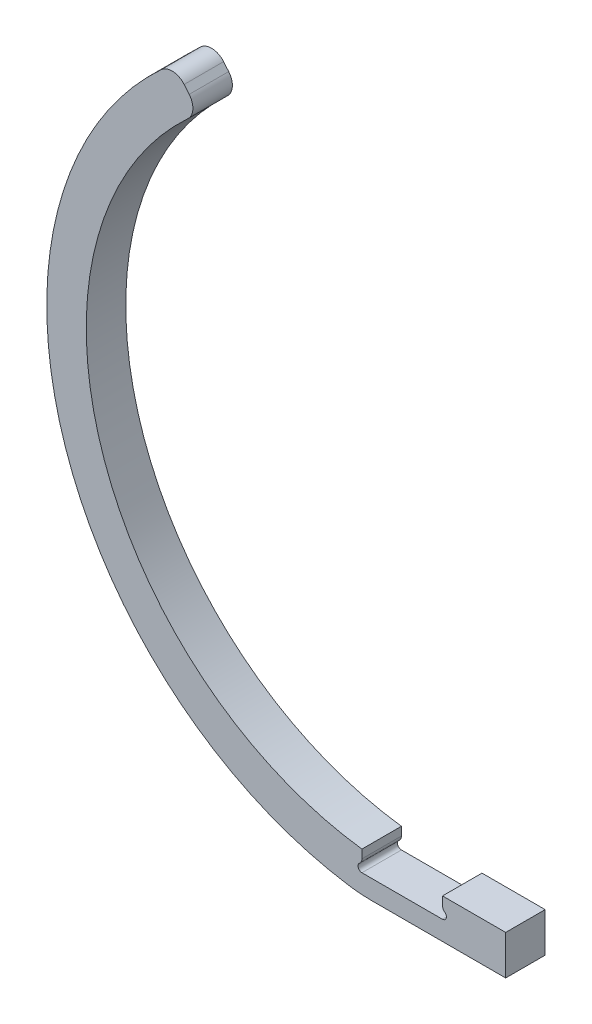
ISO-10303-21;
HEADER;
FILE_DESCRIPTION(('STEP AP214'),'2;1');
FILE_NAME('part.step','',(''),(''),'','','');
FILE_SCHEMA(('AUTOMOTIVE_DESIGN { 1 0 10303 214 1 1 1 1 }'));
ENDSEC;
DATA;
#1=APPLICATION_CONTEXT('core data for automotive mechanical design processes');
#2=APPLICATION_PROTOCOL_DEFINITION('international standard','automotive_design',2000,#1);
#3=PRODUCT_CONTEXT('',#1,'mechanical');
#4=PRODUCT('Part','Part','',(#3));
#5=PRODUCT_RELATED_PRODUCT_CATEGORY('part','',(#4));
#6=PRODUCT_DEFINITION_FORMATION('','',#4);
#7=PRODUCT_DEFINITION_CONTEXT('part definition',#1,'design');
#8=PRODUCT_DEFINITION('design','',#6,#7);
#9=PRODUCT_DEFINITION_SHAPE('','',#8);
#10=(LENGTH_UNIT() NAMED_UNIT(*) SI_UNIT(.MILLI.,.METRE.));
#11=(NAMED_UNIT(*) PLANE_ANGLE_UNIT() SI_UNIT($,.RADIAN.));
#12=(NAMED_UNIT(*) SI_UNIT($,.STERADIAN.) SOLID_ANGLE_UNIT());
#13=UNCERTAINTY_MEASURE_WITH_UNIT(LENGTH_MEASURE(1.E-05),#10,'distance_accuracy_value','');
#14=(GEOMETRIC_REPRESENTATION_CONTEXT(3) GLOBAL_UNCERTAINTY_ASSIGNED_CONTEXT((#13)) GLOBAL_UNIT_ASSIGNED_CONTEXT((#10,
#11,#12)) REPRESENTATION_CONTEXT('',''));
#15=CARTESIAN_POINT('',(0.,0.,0.));
#16=DIRECTION('',(0.,0.,1.));
#17=DIRECTION('',(1.,0.,0.));
#18=AXIS2_PLACEMENT_3D('',#15,#16,#17);
#19=CARTESIAN_POINT('',(0.,0.,6.35));
#20=DIRECTION('',(0.766044443118976,0.642787609686541,0.));
#21=DIRECTION('',(-0.642787609686541,0.766044443118977,0.));
#22=AXIS2_PLACEMENT_3D('',#19,#20,#21);
#23=PLANE('',#22);
#24=DIRECTION('',(0.642787609686541,-0.766044443118977,0.));
#25=VECTOR('',#24,1.);
#26=CARTESIAN_POINT('',(0.,0.,0.));
#27=LINE('',#26,#25);
#28=CARTESIAN_POINT('',(-35.0646414930673,41.7884124723908,0.));
#29=VERTEX_POINT('',#28);
#30=CARTESIAN_POINT('',(-34.247395692696,40.8144568537658,0.));
#31=VERTEX_POINT('',#30);
#32=EDGE_CURVE('E283',#29,#31,#27,.T.);
#33=ORIENTED_EDGE('',*,*,#32,.F.);
#34=DIRECTION('',(0.,0.,-1.));
#35=VECTOR('',#34,1.);
#36=CARTESIAN_POINT('',(-35.0646414930673,41.7884124723908,6.35));
#37=LINE('',#36,#35);
#38=CARTESIAN_POINT('',(-35.0646414930673,41.7884124723908,6.35));
#39=VERTEX_POINT('',#38);
#40=EDGE_CURVE('E165',#39,#29,#37,.T.);
#41=ORIENTED_EDGE('',*,*,#40,.F.);
#42=DIRECTION('',(0.642787609686541,-0.766044443118977,0.));
#43=VECTOR('',#42,1.);
#44=CARTESIAN_POINT('',(0.,0.,6.35));
#45=LINE('',#44,#43);
#46=CARTESIAN_POINT('',(-34.247395692696,40.8144568537658,6.35));
#47=VERTEX_POINT('',#46);
#48=EDGE_CURVE('E196',#39,#47,#45,.T.);
#49=ORIENTED_EDGE('',*,*,#48,.T.);
#50=DIRECTION('',(0.,0.,-1.));
#51=VECTOR('',#50,1.);
#52=CARTESIAN_POINT('',(-34.247395692696,40.8144568537658,6.35));
#53=LINE('',#52,#51);
#54=EDGE_CURVE('E197',#47,#31,#53,.T.);
#55=ORIENTED_EDGE('',*,*,#54,.T.);
#56=EDGE_LOOP('',(#33,#41,#49,#55));
#57=FACE_BOUND('',#56,.T.);
#58=ADVANCED_FACE('F42',(#57),#23,.T.);
#59=CARTESIAN_POINT('',(-37.0103943785895,40.155731943787,6.35));
#60=DIRECTION('',(0.,0.,-1.));
#61=DIRECTION('',(-1.,0.,0.));
#62=AXIS2_PLACEMENT_3D('',#59,#60,#61);
#63=CYLINDRICAL_SURFACE('',#62,2.54);
#64=CARTESIAN_POINT('',(-37.0103943785895,40.155731943787,0.));
#65=DIRECTION('',(0.,0.,1.));
#66=DIRECTION('',(1.,0.,0.));
#67=AXIS2_PLACEMENT_3D('',#64,#65,#66);
#68=CIRCLE('',#67,2.54);
#69=CARTESIAN_POINT('',(-38.7318080706169,42.0234404062887,0.));
#70=VERTEX_POINT('',#69);
#71=EDGE_CURVE('E251',#29,#70,#68,.T.);
#72=ORIENTED_EDGE('',*,*,#71,.T.);
#73=DIRECTION('',(0.,0.,-1.));
#74=VECTOR('',#73,1.);
#75=CARTESIAN_POINT('',(-38.7318080706169,42.0234404062887,6.35));
#76=LINE('',#75,#74);
#77=CARTESIAN_POINT('',(-38.7318080706169,42.0234404062887,6.35));
#78=VERTEX_POINT('',#77);
#79=EDGE_CURVE('E213',#78,#70,#76,.T.);
#80=ORIENTED_EDGE('',*,*,#79,.F.);
#81=CARTESIAN_POINT('',(-37.0103943785895,40.155731943787,6.35));
#82=DIRECTION('',(0.,0.,1.));
#83=DIRECTION('',(1.,0.,0.));
#84=AXIS2_PLACEMENT_3D('',#81,#82,#83);
#85=CIRCLE('',#84,2.54);
#86=EDGE_CURVE('E292',#39,#78,#85,.T.);
#87=ORIENTED_EDGE('',*,*,#86,.F.);
#88=ORIENTED_EDGE('',*,*,#40,.T.);
#89=EDGE_LOOP('',(#72,#80,#87,#88));
#90=FACE_BOUND('',#89,.T.);
#91=ADVANCED_FACE('F288',(#90),#63,.T.);
#92=CARTESIAN_POINT('',(0.,0.,6.35));
#93=DIRECTION('',(0.,0.,-1.));
#94=DIRECTION('',(-1.,0.,0.));
#95=AXIS2_PLACEMENT_3D('',#92,#93,#94);
#96=CYLINDRICAL_SURFACE('',#95,57.15);
#97=CARTESIAN_POINT('',(0.,0.,0.));
#98=DIRECTION('',(0.,0.,1.));
#99=DIRECTION('',(1.,0.,0.));
#100=AXIS2_PLACEMENT_3D('',#97,#98,#99);
#101=CIRCLE('',#100,57.15);
#102=CARTESIAN_POINT('',(-8.67856626583688,-56.4872108319173,0.));
#103=VERTEX_POINT('',#102);
#104=EDGE_CURVE('E248',#70,#103,#101,.T.);
#105=ORIENTED_EDGE('',*,*,#104,.T.);
#106=DIRECTION('',(0.,0.,-1.));
#107=VECTOR('',#106,1.);
#108=CARTESIAN_POINT('',(-8.67856626583688,-56.4872108319173,6.35));
#109=LINE('',#108,#107);
#110=CARTESIAN_POINT('',(-8.67856626583688,-56.4872108319173,6.35));
#111=VERTEX_POINT('',#110);
#112=EDGE_CURVE('E50',#103,#111,#109,.F.);
#113=ORIENTED_EDGE('',*,*,#112,.T.);
#114=CARTESIAN_POINT('',(0.,0.,6.35));
#115=DIRECTION('',(0.,0.,1.));
#116=DIRECTION('',(1.,0.,0.));
#117=AXIS2_PLACEMENT_3D('',#114,#115,#116);
#118=CIRCLE('',#117,57.15);
#119=EDGE_CURVE('E271',#78,#111,#118,.T.);
#120=ORIENTED_EDGE('',*,*,#119,.F.);
#121=ORIENTED_EDGE('',*,*,#79,.T.);
#122=EDGE_LOOP('',(#105,#113,#120,#121));
#123=FACE_BOUND('',#122,.T.);
#124=ADVANCED_FACE('F291',(#123),#96,.T.);
#125=CARTESIAN_POINT('',(0.,-56.7817837955096,6.35));
#126=DIRECTION('',(0.,1.,0.));
#127=DIRECTION('',(0.,0.,1.));
#128=AXIS2_PLACEMENT_3D('',#125,#126,#127);
#129=PLANE('',#128);
#130=DIRECTION('',(1.,0.,0.));
#131=VECTOR('',#130,1.);
#132=CARTESIAN_POINT('',(0.,-56.7817837955096,6.35));
#133=LINE('',#132,#131);
#134=CARTESIAN_POINT('',(-4.82142570324271,-56.7817837955096,6.35));
#135=VERTEX_POINT('',#134);
#136=CARTESIAN_POINT('',(16.637,-56.7817837955096,6.35));
#137=VERTEX_POINT('',#136);
#138=EDGE_CURVE('E241',#135,#137,#133,.T.);
#139=ORIENTED_EDGE('',*,*,#138,.F.);
#140=DIRECTION('',(0.,0.,-1.));
#141=VECTOR('',#140,1.);
#142=CARTESIAN_POINT('',(-4.82142570324271,-56.7817837955096,6.35));
#143=LINE('',#142,#141);
#144=CARTESIAN_POINT('',(-4.82142570324271,-56.7817837955096,0.));
#145=VERTEX_POINT('',#144);
#146=EDGE_CURVE('E232',#135,#145,#143,.T.);
#147=ORIENTED_EDGE('',*,*,#146,.T.);
#148=DIRECTION('',(1.,0.,0.));
#149=VECTOR('',#148,1.);
#150=CARTESIAN_POINT('',(0.,-56.7817837955096,0.));
#151=LINE('',#150,#149);
#152=CARTESIAN_POINT('',(16.637,-56.7817837955096,0.));
#153=VERTEX_POINT('',#152);
#154=EDGE_CURVE('E240',#145,#153,#151,.T.);
#155=ORIENTED_EDGE('',*,*,#154,.T.);
#156=DIRECTION('',(0.,0.,-1.));
#157=VECTOR('',#156,1.);
#158=CARTESIAN_POINT('',(16.637,-56.7817837955096,6.35));
#159=LINE('',#158,#157);
#160=EDGE_CURVE('E210',#137,#153,#159,.T.);
#161=ORIENTED_EDGE('',*,*,#160,.F.);
#162=EDGE_LOOP('',(#139,#147,#155,#161));
#163=FACE_BOUND('',#162,.T.);
#164=ADVANCED_FACE('F238',(#163),#129,.F.);
#165=CARTESIAN_POINT('',(16.637,0.,6.35));
#166=DIRECTION('',(1.,0.,0.));
#167=DIRECTION('',(0.,0.,-1.));
#168=AXIS2_PLACEMENT_3D('',#165,#166,#167);
#169=PLANE('',#168);
#170=DIRECTION('',(0.,-1.,0.));
#171=VECTOR('',#170,1.);
#172=CARTESIAN_POINT('',(16.637,0.,0.));
#173=LINE('',#172,#171);
#174=CARTESIAN_POINT('',(16.637,-50.4317837955096,0.));
#175=VERTEX_POINT('',#174);
#176=EDGE_CURVE('E247',#175,#153,#173,.T.);
#177=ORIENTED_EDGE('',*,*,#176,.F.);
#178=DIRECTION('',(0.,0.,-1.));
#179=VECTOR('',#178,1.);
#180=CARTESIAN_POINT('',(16.637,-50.4317837955096,6.35));
#181=LINE('',#180,#179);
#182=CARTESIAN_POINT('',(16.637,-50.4317837955096,6.35));
#183=VERTEX_POINT('',#182);
#184=EDGE_CURVE('E208',#183,#175,#181,.T.);
#185=ORIENTED_EDGE('',*,*,#184,.F.);
#186=DIRECTION('',(0.,-1.,0.));
#187=VECTOR('',#186,1.);
#188=CARTESIAN_POINT('',(16.637,0.,6.35));
#189=LINE('',#188,#187);
#190=EDGE_CURVE('E266',#183,#137,#189,.T.);
#191=ORIENTED_EDGE('',*,*,#190,.T.);
#192=ORIENTED_EDGE('',*,*,#160,.T.);
#193=EDGE_LOOP('',(#177,#185,#191,#192));
#194=FACE_BOUND('',#193,.T.);
#195=ADVANCED_FACE('F265',(#194),#169,.T.);
#196=CARTESIAN_POINT('',(0.,-50.4317837955096,6.35));
#197=DIRECTION('',(0.,1.,0.));
#198=DIRECTION('',(0.,0.,1.));
#199=AXIS2_PLACEMENT_3D('',#196,#197,#198);
#200=PLANE('',#199);
#201=DIRECTION('',(1.,0.,0.));
#202=VECTOR('',#201,1.);
#203=CARTESIAN_POINT('',(0.,-50.4317837955096,0.));
#204=LINE('',#203,#202);
#205=CARTESIAN_POINT('',(6.477,-50.4317837955096,0.));
#206=VERTEX_POINT('',#205);
#207=EDGE_CURVE('E187',#206,#175,#204,.T.);
#208=ORIENTED_EDGE('',*,*,#207,.F.);
#209=DIRECTION('',(0.,0.,-1.));
#210=VECTOR('',#209,1.);
#211=CARTESIAN_POINT('',(6.477,-50.4317837955096,6.35));
#212=LINE('',#211,#210);
#213=CARTESIAN_POINT('',(6.477,-50.4317837955096,6.35));
#214=VERTEX_POINT('',#213);
#215=EDGE_CURVE('E175',#214,#206,#212,.T.);
#216=ORIENTED_EDGE('',*,*,#215,.F.);
#217=DIRECTION('',(1.,0.,0.));
#218=VECTOR('',#217,1.);
#219=CARTESIAN_POINT('',(0.,-50.4317837955096,6.35));
#220=LINE('',#219,#218);
#221=EDGE_CURVE('E261',#214,#183,#220,.T.);
#222=ORIENTED_EDGE('',*,*,#221,.T.);
#223=ORIENTED_EDGE('',*,*,#184,.T.);
#224=EDGE_LOOP('',(#208,#216,#222,#223));
#225=FACE_BOUND('',#224,.T.);
#226=ADVANCED_FACE('F258',(#225),#200,.T.);
#227=CARTESIAN_POINT('',(6.477,0.,6.35));
#228=DIRECTION('',(-1.,0.,0.));
#229=DIRECTION('',(0.,0.,1.));
#230=AXIS2_PLACEMENT_3D('',#227,#228,#229);
#231=PLANE('',#230);
#232=DIRECTION('',(0.,1.,0.));
#233=VECTOR('',#232,1.);
#234=CARTESIAN_POINT('',(6.477,0.,0.));
#235=LINE('',#234,#233);
#236=CARTESIAN_POINT('',(6.477,-51.7466210482328,0.));
#237=VERTEX_POINT('',#236);
#238=EDGE_CURVE('E183',#237,#206,#235,.T.);
#239=ORIENTED_EDGE('',*,*,#238,.F.);
#240=DIRECTION('',(0.,0.,-1.));
#241=VECTOR('',#240,1.);
#242=CARTESIAN_POINT('',(6.477,-51.7466210482328,6.35));
#243=LINE('',#242,#241);
#244=CARTESIAN_POINT('',(6.477,-51.7466210482328,6.35));
#245=VERTEX_POINT('',#244);
#246=EDGE_CURVE('E230',#237,#245,#243,.F.);
#247=ORIENTED_EDGE('',*,*,#246,.T.);
#248=DIRECTION('',(0.,1.,0.));
#249=VECTOR('',#248,1.);
#250=CARTESIAN_POINT('',(6.477,0.,6.35));
#251=LINE('',#250,#249);
#252=EDGE_CURVE('E269',#245,#214,#251,.T.);
#253=ORIENTED_EDGE('',*,*,#252,.T.);
#254=ORIENTED_EDGE('',*,*,#215,.T.);
#255=EDGE_LOOP('',(#239,#247,#253,#254));
#256=FACE_BOUND('',#255,.T.);
#257=ADVANCED_FACE('F313',(#256),#231,.T.);
#258=CARTESIAN_POINT('',(0.,-53.6829837955096,6.35));
#259=DIRECTION('',(0.,1.,0.));
#260=DIRECTION('',(0.,0.,1.));
#261=AXIS2_PLACEMENT_3D('',#258,#259,#260);
#262=PLANE('',#261);
#263=DIRECTION('',(1.,0.,0.));
#264=VECTOR('',#263,1.);
#265=CARTESIAN_POINT('',(0.,-53.6829837955096,0.));
#266=LINE('',#265,#264);
#267=CARTESIAN_POINT('',(-6.477,-53.6829837955096,0.));
#268=VERTEX_POINT('',#267);
#269=CARTESIAN_POINT('',(6.477,-53.6829837955096,0.));
#270=VERTEX_POINT('',#269);
#271=EDGE_CURVE('E172',#268,#270,#266,.T.);
#272=ORIENTED_EDGE('',*,*,#271,.F.);
#273=DIRECTION('',(0.,0.,-1.));
#274=VECTOR('',#273,1.);
#275=CARTESIAN_POINT('',(-6.477,-53.6829837955096,6.35));
#276=LINE('',#275,#274);
#277=CARTESIAN_POINT('',(-6.477,-53.6829837955096,6.35));
#278=VERTEX_POINT('',#277);
#279=EDGE_CURVE('E176',#278,#268,#276,.T.);
#280=ORIENTED_EDGE('',*,*,#279,.F.);
#281=DIRECTION('',(1.,0.,0.));
#282=VECTOR('',#281,1.);
#283=CARTESIAN_POINT('',(0.,-53.6829837955096,6.35));
#284=LINE('',#283,#282);
#285=CARTESIAN_POINT('',(6.477,-53.6829837955096,6.35));
#286=VERTEX_POINT('',#285);
#287=EDGE_CURVE('E174',#278,#286,#284,.T.);
#288=ORIENTED_EDGE('',*,*,#287,.T.);
#289=DIRECTION('',(0.,0.,-1.));
#290=VECTOR('',#289,1.);
#291=CARTESIAN_POINT('',(6.477,-53.6829837955096,6.35));
#292=LINE('',#291,#290);
#293=EDGE_CURVE('E159',#286,#270,#292,.T.);
#294=ORIENTED_EDGE('',*,*,#293,.T.);
#295=EDGE_LOOP('',(#272,#280,#288,#294));
#296=FACE_BOUND('',#295,.T.);
#297=ADVANCED_FACE('F170',(#296),#262,.T.);
#298=CARTESIAN_POINT('',(-6.47700000000001,0.,6.35));
#299=DIRECTION('',(-1.,0.,0.));
#300=DIRECTION('',(0.,-1.,0.));
#301=AXIS2_PLACEMENT_3D('',#298,#299,#300);
#302=PLANE('',#301);
#303=DIRECTION('',(0.,1.,0.));
#304=VECTOR('',#303,1.);
#305=CARTESIAN_POINT('',(-6.47700000000001,0.,6.35));
#306=LINE('',#305,#304);
#307=CARTESIAN_POINT('',(-6.477,-51.7466210482328,6.35));
#308=VERTEX_POINT('',#307);
#309=CARTESIAN_POINT('',(-6.477,-50.3853993831546,6.35));
#310=VERTEX_POINT('',#309);
#311=EDGE_CURVE('E277',#308,#310,#306,.T.);
#312=ORIENTED_EDGE('',*,*,#311,.F.);
#313=DIRECTION('',(0.,0.,1.));
#314=VECTOR('',#313,1.);
#315=CARTESIAN_POINT('',(-6.477,-51.7466210482328,6.35));
#316=LINE('',#315,#314);
#317=CARTESIAN_POINT('',(-6.477,-51.7466210482328,0.));
#318=VERTEX_POINT('',#317);
#319=EDGE_CURVE('E164',#308,#318,#316,.F.);
#320=ORIENTED_EDGE('',*,*,#319,.T.);
#321=DIRECTION('',(0.,1.,0.));
#322=VECTOR('',#321,1.);
#323=CARTESIAN_POINT('',(-6.47700000000001,0.,0.));
#324=LINE('',#323,#322);
#325=CARTESIAN_POINT('',(-6.477,-50.3853993831546,0.));
#326=VERTEX_POINT('',#325);
#327=EDGE_CURVE('E182',#318,#326,#324,.T.);
#328=ORIENTED_EDGE('',*,*,#327,.T.);
#329=DIRECTION('',(0.,0.,-1.));
#330=VECTOR('',#329,1.);
#331=CARTESIAN_POINT('',(-6.477,-50.3853993831546,6.35));
#332=LINE('',#331,#330);
#333=EDGE_CURVE('E202',#310,#326,#332,.T.);
#334=ORIENTED_EDGE('',*,*,#333,.F.);
#335=EDGE_LOOP('',(#312,#320,#328,#334));
#336=FACE_BOUND('',#335,.T.);
#337=ADVANCED_FACE('F320',(#336),#302,.F.);
#338=CARTESIAN_POINT('',(0.,0.,6.35));
#339=DIRECTION('',(0.,0.,-1.));
#340=DIRECTION('',(-1.,0.,0.));
#341=AXIS2_PLACEMENT_3D('',#338,#339,#340);
#342=CYLINDRICAL_SURFACE('',#341,50.8);
#343=CARTESIAN_POINT('',(0.,0.,0.));
#344=DIRECTION('',(0.,0.,1.));
#345=DIRECTION('',(1.,0.,0.));
#346=AXIS2_PLACEMENT_3D('',#343,#344,#345);
#347=CIRCLE('',#346,50.8);
#348=CARTESIAN_POINT('',(-34.4696653125887,37.3159774525352,0.));
#349=VERTEX_POINT('',#348);
#350=EDGE_CURVE('E185',#349,#326,#347,.T.);
#351=ORIENTED_EDGE('',*,*,#350,.F.);
#352=DIRECTION('',(0.,0.,-1.));
#353=VECTOR('',#352,1.);
#354=CARTESIAN_POINT('',(-34.4696653125887,37.3159774525352,6.35));
#355=LINE('',#354,#353);
#356=CARTESIAN_POINT('',(-34.4696653125887,37.3159774525352,6.35));
#357=VERTEX_POINT('',#356);
#358=EDGE_CURVE('E199',#357,#349,#355,.T.);
#359=ORIENTED_EDGE('',*,*,#358,.F.);
#360=CARTESIAN_POINT('',(0.,0.,6.35));
#361=DIRECTION('',(0.,0.,1.));
#362=DIRECTION('',(1.,0.,0.));
#363=AXIS2_PLACEMENT_3D('',#360,#361,#362);
#364=CIRCLE('',#363,50.8);
#365=EDGE_CURVE('E279',#357,#310,#364,.T.);
#366=ORIENTED_EDGE('',*,*,#365,.T.);
#367=ORIENTED_EDGE('',*,*,#333,.T.);
#368=EDGE_LOOP('',(#351,#359,#366,#367));
#369=FACE_BOUND('',#368,.T.);
#370=ADVANCED_FACE('F413',(#369),#342,.F.);
#371=CARTESIAN_POINT('',(-36.1931485782182,39.181776325162,6.35));
#372=DIRECTION('',(0.,0.,-1.));
#373=DIRECTION('',(-1.,0.,0.));
#374=AXIS2_PLACEMENT_3D('',#371,#372,#373);
#375=CYLINDRICAL_SURFACE('',#374,2.54);
#376=CARTESIAN_POINT('',(-36.1931485782182,39.181776325162,0.));
#377=DIRECTION('',(0.,0.,1.));
#378=DIRECTION('',(1.,0.,0.));
#379=AXIS2_PLACEMENT_3D('',#376,#377,#378);
#380=CIRCLE('',#379,2.54);
#381=EDGE_CURVE('E193',#349,#31,#380,.T.);
#382=ORIENTED_EDGE('',*,*,#381,.T.);
#383=ORIENTED_EDGE('',*,*,#54,.F.);
#384=CARTESIAN_POINT('',(-36.1931485782182,39.181776325162,6.35));
#385=DIRECTION('',(0.,0.,1.));
#386=DIRECTION('',(1.,0.,0.));
#387=AXIS2_PLACEMENT_3D('',#384,#385,#386);
#388=CIRCLE('',#387,2.54);
#389=EDGE_CURVE('E200',#357,#47,#388,.T.);
#390=ORIENTED_EDGE('',*,*,#389,.F.);
#391=ORIENTED_EDGE('',*,*,#358,.T.);
#392=EDGE_LOOP('',(#382,#383,#390,#391));
#393=FACE_BOUND('',#392,.T.);
#394=ADVANCED_FACE('F361',(#393),#375,.T.);
#395=CARTESIAN_POINT('',(0.,0.,6.35));
#396=DIRECTION('',(0.,0.,1.));
#397=DIRECTION('',(1.,0.,0.));
#398=AXIS2_PLACEMENT_3D('',#395,#396,#397);
#399=PLANE('',#398);
#400=ORIENTED_EDGE('',*,*,#119,.T.);
#401=CARTESIAN_POINT('',(-4.82142570324271,-31.3817837955096,6.35));
#402=DIRECTION('',(0.,0.,1.));
#403=DIRECTION('',(1.,0.,0.));
#404=AXIS2_PLACEMENT_3D('',#401,#402,#403);
#405=CIRCLE('',#404,25.4);
#406=EDGE_CURVE('E11',#111,#135,#405,.T.);
#407=ORIENTED_EDGE('',*,*,#406,.T.);
#408=ORIENTED_EDGE('',*,*,#138,.T.);
#409=ORIENTED_EDGE('',*,*,#190,.F.);
#410=ORIENTED_EDGE('',*,*,#221,.F.);
#411=ORIENTED_EDGE('',*,*,#252,.F.);
#412=CARTESIAN_POINT('',(7.493,-51.7466210482328,6.35));
#413=DIRECTION('',(0.,0.,1.));
#414=DIRECTION('',(1.,0.,0.));
#415=AXIS2_PLACEMENT_3D('',#412,#413,#414);
#416=CIRCLE('',#415,1.016);
#417=CARTESIAN_POINT('',(6.86776923076923,-52.5474596619416,6.35));
#418=VERTEX_POINT('',#417);
#419=EDGE_CURVE('E225',#245,#418,#416,.T.);
#420=ORIENTED_EDGE('',*,*,#419,.T.);
#421=CARTESIAN_POINT('',(6.477,-53.0479837955096,6.35));
#422=DIRECTION('',(0.,0.,1.));
#423=DIRECTION('',(1.,0.,0.));
#424=AXIS2_PLACEMENT_3D('',#421,#422,#423);
#425=CIRCLE('',#424,0.635000000000001);
#426=EDGE_CURVE('E297',#286,#418,#425,.T.);
#427=ORIENTED_EDGE('',*,*,#426,.F.);
#428=ORIENTED_EDGE('',*,*,#287,.F.);
#429=CARTESIAN_POINT('',(-6.477,-53.0479837955096,6.35));
#430=DIRECTION('',(0.,0.,1.));
#431=DIRECTION('',(1.,0.,0.));
#432=AXIS2_PLACEMENT_3D('',#429,#430,#431);
#433=CIRCLE('',#432,0.635000000000001);
#434=CARTESIAN_POINT('',(-6.86776923076923,-52.5474596619416,6.35));
#435=VERTEX_POINT('',#434);
#436=EDGE_CURVE('E299',#435,#278,#433,.T.);
#437=ORIENTED_EDGE('',*,*,#436,.F.);
#438=CARTESIAN_POINT('',(-7.493,-51.7466210482328,6.35));
#439=DIRECTION('',(0.,0.,1.));
#440=DIRECTION('',(1.,0.,0.));
#441=AXIS2_PLACEMENT_3D('',#438,#439,#440);
#442=CIRCLE('',#441,1.016);
#443=EDGE_CURVE('E227',#435,#308,#442,.T.);
#444=ORIENTED_EDGE('',*,*,#443,.T.);
#445=ORIENTED_EDGE('',*,*,#311,.T.);
#446=ORIENTED_EDGE('',*,*,#365,.F.);
#447=ORIENTED_EDGE('',*,*,#389,.T.);
#448=ORIENTED_EDGE('',*,*,#48,.F.);
#449=ORIENTED_EDGE('',*,*,#86,.T.);
#450=EDGE_LOOP('',(#400,#407,#408,#409,#410,#411,#420,#427,#428,#437,#444,#445,#446,#447,#448,#449));
#451=FACE_BOUND('',#450,.T.);
#452=ADVANCED_FACE('F306',(#451),#399,.T.);
#453=CARTESIAN_POINT('',(0.,0.,0.));
#454=DIRECTION('',(0.,0.,1.));
#455=DIRECTION('',(1.,0.,0.));
#456=AXIS2_PLACEMENT_3D('',#453,#454,#455);
#457=PLANE('',#456);
#458=ORIENTED_EDGE('',*,*,#154,.F.);
#459=CARTESIAN_POINT('',(-4.82142570324271,-31.3817837955096,0.));
#460=DIRECTION('',(0.,0.,1.));
#461=DIRECTION('',(1.,0.,0.));
#462=AXIS2_PLACEMENT_3D('',#459,#460,#461);
#463=CIRCLE('',#462,25.4);
#464=EDGE_CURVE('E64',#145,#103,#463,.F.);
#465=ORIENTED_EDGE('',*,*,#464,.T.);
#466=ORIENTED_EDGE('',*,*,#104,.F.);
#467=ORIENTED_EDGE('',*,*,#71,.F.);
#468=ORIENTED_EDGE('',*,*,#32,.T.);
#469=ORIENTED_EDGE('',*,*,#381,.F.);
#470=ORIENTED_EDGE('',*,*,#350,.T.);
#471=ORIENTED_EDGE('',*,*,#327,.F.);
#472=CARTESIAN_POINT('',(-7.493,-51.7466210482328,0.));
#473=DIRECTION('',(0.,0.,1.));
#474=DIRECTION('',(1.,0.,0.));
#475=AXIS2_PLACEMENT_3D('',#472,#473,#474);
#476=CIRCLE('',#475,1.016);
#477=CARTESIAN_POINT('',(-6.86776923076923,-52.5474596619416,0.));
#478=VERTEX_POINT('',#477);
#479=EDGE_CURVE('E221',#318,#478,#476,.F.);
#480=ORIENTED_EDGE('',*,*,#479,.T.);
#481=CARTESIAN_POINT('',(-6.477,-53.0479837955096,0.));
#482=DIRECTION('',(0.,0.,1.));
#483=DIRECTION('',(1.,0.,0.));
#484=AXIS2_PLACEMENT_3D('',#481,#482,#483);
#485=CIRCLE('',#484,0.635000000000001);
#486=EDGE_CURVE('E180',#478,#268,#485,.T.);
#487=ORIENTED_EDGE('',*,*,#486,.T.);
#488=ORIENTED_EDGE('',*,*,#271,.T.);
#489=CARTESIAN_POINT('',(6.477,-53.0479837955096,0.));
#490=DIRECTION('',(0.,0.,1.));
#491=DIRECTION('',(1.,0.,0.));
#492=AXIS2_PLACEMENT_3D('',#489,#490,#491);
#493=CIRCLE('',#492,0.635000000000001);
#494=CARTESIAN_POINT('',(6.86776923076923,-52.5474596619416,0.));
#495=VERTEX_POINT('',#494);
#496=EDGE_CURVE('E155',#270,#495,#493,.T.);
#497=ORIENTED_EDGE('',*,*,#496,.T.);
#498=CARTESIAN_POINT('',(7.493,-51.7466210482328,0.));
#499=DIRECTION('',(0.,0.,1.));
#500=DIRECTION('',(1.,0.,0.));
#501=AXIS2_PLACEMENT_3D('',#498,#499,#500);
#502=CIRCLE('',#501,1.016);
#503=EDGE_CURVE('E219',#495,#237,#502,.F.);
#504=ORIENTED_EDGE('',*,*,#503,.T.);
#505=ORIENTED_EDGE('',*,*,#238,.T.);
#506=ORIENTED_EDGE('',*,*,#207,.T.);
#507=ORIENTED_EDGE('',*,*,#176,.T.);
#508=EDGE_LOOP('',(#458,#465,#466,#467,#468,#469,#470,#471,#480,#487,#488,#497,#504,#505,#506,#507));
#509=FACE_BOUND('',#508,.T.);
#510=ADVANCED_FACE('F178',(#509),#457,.F.);
#511=CARTESIAN_POINT('',(6.477,-53.0479837955096,0.));
#512=DIRECTION('',(0.,0.,1.));
#513=DIRECTION('',(1.,0.,0.));
#514=AXIS2_PLACEMENT_3D('',#511,#512,#513);
#515=CYLINDRICAL_SURFACE('',#514,0.635000000000001);
#516=ORIENTED_EDGE('',*,*,#426,.T.);
#517=DIRECTION('',(0.,0.,1.));
#518=VECTOR('',#517,1.);
#519=CARTESIAN_POINT('',(6.86776923076923,-52.5474596619416,0.));
#520=LINE('',#519,#518);
#521=EDGE_CURVE('E162',#418,#495,#520,.F.);
#522=ORIENTED_EDGE('',*,*,#521,.T.);
#523=ORIENTED_EDGE('',*,*,#496,.F.);
#524=ORIENTED_EDGE('',*,*,#293,.F.);
#525=EDGE_LOOP('',(#516,#522,#523,#524));
#526=FACE_BOUND('',#525,.T.);
#527=ADVANCED_FACE('F158',(#526),#515,.F.);
#528=CARTESIAN_POINT('',(-6.477,-53.0479837955096,0.));
#529=DIRECTION('',(0.,0.,1.));
#530=DIRECTION('',(1.,0.,0.));
#531=AXIS2_PLACEMENT_3D('',#528,#529,#530);
#532=CYLINDRICAL_SURFACE('',#531,0.635000000000001);
#533=ORIENTED_EDGE('',*,*,#486,.F.);
#534=DIRECTION('',(0.,0.,1.));
#535=VECTOR('',#534,1.);
#536=CARTESIAN_POINT('',(-6.86776923076923,-52.5474596619416,0.));
#537=LINE('',#536,#535);
#538=EDGE_CURVE('E223',#478,#435,#537,.T.);
#539=ORIENTED_EDGE('',*,*,#538,.T.);
#540=ORIENTED_EDGE('',*,*,#436,.T.);
#541=ORIENTED_EDGE('',*,*,#279,.T.);
#542=EDGE_LOOP('',(#533,#539,#540,#541));
#543=FACE_BOUND('',#542,.T.);
#544=ADVANCED_FACE('F303',(#543),#532,.F.);
#545=CARTESIAN_POINT('',(-7.493,-51.7466210482328,0.));
#546=DIRECTION('',(0.,0.,1.));
#547=DIRECTION('',(1.,0.,0.));
#548=AXIS2_PLACEMENT_3D('',#545,#546,#547);
#549=CYLINDRICAL_SURFACE('',#548,1.016);
#550=ORIENTED_EDGE('',*,*,#443,.F.);
#551=ORIENTED_EDGE('',*,*,#538,.F.);
#552=ORIENTED_EDGE('',*,*,#479,.F.);
#553=ORIENTED_EDGE('',*,*,#319,.F.);
#554=EDGE_LOOP('',(#550,#551,#552,#553));
#555=FACE_BOUND('',#554,.T.);
#556=ADVANCED_FACE('F332',(#555),#549,.T.);
#557=CARTESIAN_POINT('',(7.493,-51.7466210482328,0.));
#558=DIRECTION('',(0.,0.,1.));
#559=DIRECTION('',(1.,0.,0.));
#560=AXIS2_PLACEMENT_3D('',#557,#558,#559);
#561=CYLINDRICAL_SURFACE('',#560,1.016);
#562=ORIENTED_EDGE('',*,*,#419,.F.);
#563=ORIENTED_EDGE('',*,*,#246,.F.);
#564=ORIENTED_EDGE('',*,*,#503,.F.);
#565=ORIENTED_EDGE('',*,*,#521,.F.);
#566=EDGE_LOOP('',(#562,#563,#564,#565));
#567=FACE_BOUND('',#566,.T.);
#568=ADVANCED_FACE('F310',(#567),#561,.T.);
#569=CARTESIAN_POINT('',(-4.82142570324271,-31.3817837955096,6.35));
#570=DIRECTION('',(0.,0.,-1.));
#571=DIRECTION('',(-1.,0.,0.));
#572=AXIS2_PLACEMENT_3D('',#569,#570,#571);
#573=CYLINDRICAL_SURFACE('',#572,25.4);
#574=ORIENTED_EDGE('',*,*,#406,.F.);
#575=ORIENTED_EDGE('',*,*,#112,.F.);
#576=ORIENTED_EDGE('',*,*,#464,.F.);
#577=ORIENTED_EDGE('',*,*,#146,.F.);
#578=EDGE_LOOP('',(#574,#575,#576,#577));
#579=FACE_BOUND('',#578,.T.);
#580=ADVANCED_FACE('F44',(#579),#573,.T.);
#581=CLOSED_SHELL('',(#58,#91,#124,#164,#195,#226,#257,#297,#337,#370,#394,#452,#510,#527,#544,
#556,#568,#580));
#582=MANIFOLD_SOLID_BREP('B2',#581);
#583=ADVANCED_BREP_SHAPE_REPRESENTATION('',(#18,#582),#14);
#584=SHAPE_DEFINITION_REPRESENTATION(#9,#583);
ENDSEC;
END-ISO-10303-21;
